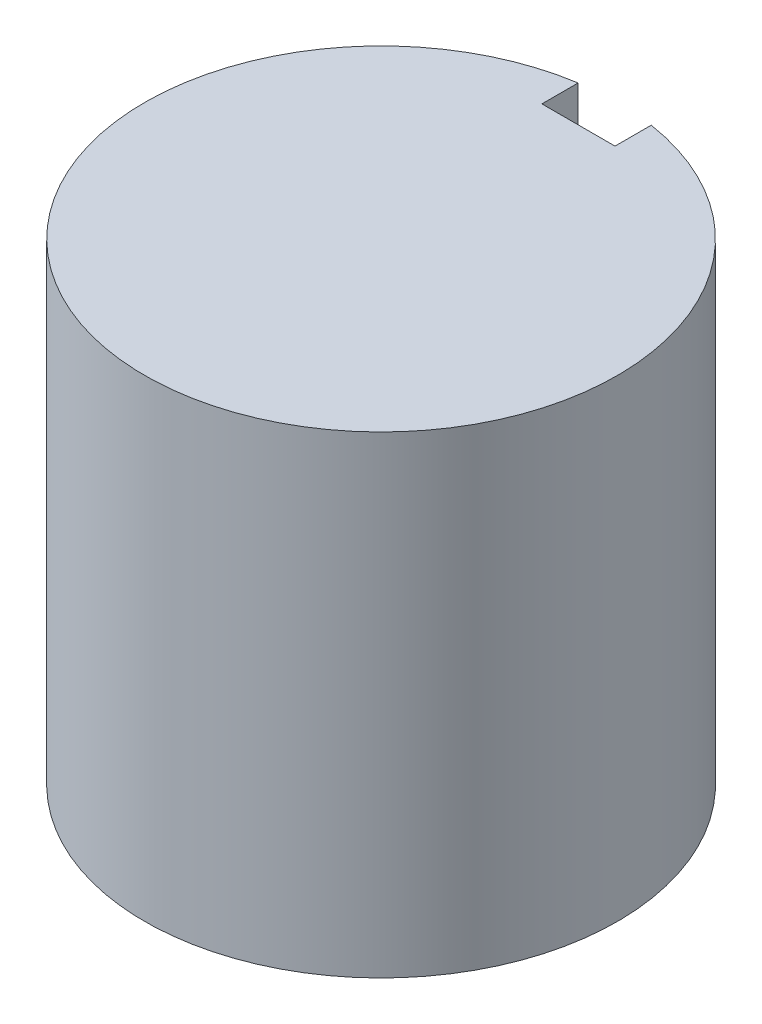
ISO-10303-21;
HEADER;
FILE_DESCRIPTION(('STEP AP214'),'2;1');
FILE_NAME('part.step','',(''),(''),'','','');
FILE_SCHEMA(('AUTOMOTIVE_DESIGN { 1 0 10303 214 1 1 1 1 }'));
ENDSEC;
DATA;
#1=APPLICATION_CONTEXT('core data for automotive mechanical design processes');
#2=APPLICATION_PROTOCOL_DEFINITION('international standard','automotive_design',2000,#1);
#3=PRODUCT_CONTEXT('',#1,'mechanical');
#4=PRODUCT('Part','Part','',(#3));
#5=PRODUCT_RELATED_PRODUCT_CATEGORY('part','',(#4));
#6=PRODUCT_DEFINITION_FORMATION('','',#4);
#7=PRODUCT_DEFINITION_CONTEXT('part definition',#1,'design');
#8=PRODUCT_DEFINITION('design','',#6,#7);
#9=PRODUCT_DEFINITION_SHAPE('','',#8);
#10=(LENGTH_UNIT() NAMED_UNIT(*) SI_UNIT(.MILLI.,.METRE.));
#11=(NAMED_UNIT(*) PLANE_ANGLE_UNIT() SI_UNIT($,.RADIAN.));
#12=(NAMED_UNIT(*) SI_UNIT($,.STERADIAN.) SOLID_ANGLE_UNIT());
#13=UNCERTAINTY_MEASURE_WITH_UNIT(LENGTH_MEASURE(1.E-05),#10,'distance_accuracy_value','');
#14=(GEOMETRIC_REPRESENTATION_CONTEXT(3) GLOBAL_UNCERTAINTY_ASSIGNED_CONTEXT((#13)) GLOBAL_UNIT_ASSIGNED_CONTEXT((#10,
#11,#12)) REPRESENTATION_CONTEXT('',''));
#15=CARTESIAN_POINT('',(0.,0.,0.));
#16=DIRECTION('',(0.,0.,1.));
#17=DIRECTION('',(1.,0.,0.));
#18=AXIS2_PLACEMENT_3D('',#15,#16,#17);
#19=CARTESIAN_POINT('',(0.,0.,-5.999988));
#20=DIRECTION('',(0.,1.,0.));
#21=DIRECTION('',(0.,0.,1.));
#22=AXIS2_PLACEMENT_3D('',#19,#20,#21);
#23=PLANE('',#22);
#24=CARTESIAN_POINT('',(0.,0.,0.));
#25=DIRECTION('',(0.,1.,0.));
#26=DIRECTION('',(1.,0.,0.));
#27=AXIS2_PLACEMENT_3D('',#24,#25,#26);
#28=CIRCLE('',#27,5.9944);
#29=CARTESIAN_POINT('',(-0.9271,0.,-5.9222729547024));
#30=VERTEX_POINT('',#29);
#31=CARTESIAN_POINT('',(0.9271,0.,-5.9222729547024));
#32=VERTEX_POINT('',#31);
#33=EDGE_CURVE('E11',#30,#32,#28,.T.);
#34=ORIENTED_EDGE('',*,*,#33,.F.);
#35=DIRECTION('',(0.,0.,-1.));
#36=VECTOR('',#35,1.);
#37=CARTESIAN_POINT('',(-0.9271,0.,-5.0038));
#38=LINE('',#37,#36);
#39=CARTESIAN_POINT('',(-0.9271,0.,-5.0038));
#40=VERTEX_POINT('',#39);
#41=EDGE_CURVE('E25',#40,#30,#38,.T.);
#42=ORIENTED_EDGE('',*,*,#41,.F.);
#43=DIRECTION('',(1.,0.,0.));
#44=VECTOR('',#43,1.);
#45=CARTESIAN_POINT('',(0.,0.,-5.0038));
#46=LINE('',#45,#44);
#47=CARTESIAN_POINT('',(0.9271,0.,-5.0038));
#48=VERTEX_POINT('',#47);
#49=EDGE_CURVE('E70',#40,#48,#46,.T.);
#50=ORIENTED_EDGE('',*,*,#49,.T.);
#51=DIRECTION('',(0.,0.,1.));
#52=VECTOR('',#51,1.);
#53=CARTESIAN_POINT('',(0.9271,0.,-5.9222729547024));
#54=LINE('',#53,#52);
#55=EDGE_CURVE('E99',#32,#48,#54,.T.);
#56=ORIENTED_EDGE('',*,*,#55,.F.);
#57=EDGE_LOOP('',(#34,#42,#50,#56));
#58=FACE_BOUND('',#57,.T.);
#59=ADVANCED_FACE('F17',(#58),#23,.F.);
#60=CARTESIAN_POINT('',(0.9271,11.9888,-5.9222729547024));
#61=DIRECTION('',(1.,0.,0.));
#62=DIRECTION('',(0.,0.,-1.));
#63=AXIS2_PLACEMENT_3D('',#60,#61,#62);
#64=PLANE('',#63);
#65=ORIENTED_EDGE('',*,*,#55,.T.);
#66=DIRECTION('',(0.,-1.,0.));
#67=VECTOR('',#66,1.);
#68=CARTESIAN_POINT('',(0.9271,11.9888,-5.0038));
#69=LINE('',#68,#67);
#70=CARTESIAN_POINT('',(0.9271,11.9888,-5.0038));
#71=VERTEX_POINT('',#70);
#72=EDGE_CURVE('E95',#71,#48,#69,.T.);
#73=ORIENTED_EDGE('',*,*,#72,.F.);
#74=DIRECTION('',(0.,0.,1.));
#75=VECTOR('',#74,1.);
#76=CARTESIAN_POINT('',(0.9271,11.9888,-5.9222729547024));
#77=LINE('',#76,#75);
#78=CARTESIAN_POINT('',(0.9271,11.9888,-5.9222729547024));
#79=VERTEX_POINT('',#78);
#80=EDGE_CURVE('E73',#79,#71,#77,.T.);
#81=ORIENTED_EDGE('',*,*,#80,.F.);
#82=DIRECTION('',(0.,-1.,0.));
#83=VECTOR('',#82,1.);
#84=CARTESIAN_POINT('',(0.9271,11.9888,-5.9222729547024));
#85=LINE('',#84,#83);
#86=EDGE_CURVE('E87',#79,#32,#85,.T.);
#87=ORIENTED_EDGE('',*,*,#86,.T.);
#88=EDGE_LOOP('',(#65,#73,#81,#87));
#89=FACE_BOUND('',#88,.T.);
#90=ADVANCED_FACE('F112',(#89),#64,.F.);
#91=CARTESIAN_POINT('',(0.,11.9888,0.));
#92=DIRECTION('',(0.,-1.,0.));
#93=DIRECTION('',(0.,0.,-1.));
#94=AXIS2_PLACEMENT_3D('',#91,#92,#93);
#95=CYLINDRICAL_SURFACE('',#94,5.9944);
#96=ORIENTED_EDGE('',*,*,#33,.T.);
#97=ORIENTED_EDGE('',*,*,#86,.F.);
#98=CARTESIAN_POINT('',(0.,11.9888,0.));
#99=DIRECTION('',(0.,1.,0.));
#100=DIRECTION('',(1.,0.,0.));
#101=AXIS2_PLACEMENT_3D('',#98,#99,#100);
#102=CIRCLE('',#101,5.9944);
#103=CARTESIAN_POINT('',(-0.9271,11.9888,-5.9222729547024));
#104=VERTEX_POINT('',#103);
#105=EDGE_CURVE('E83',#104,#79,#102,.T.);
#106=ORIENTED_EDGE('',*,*,#105,.F.);
#107=DIRECTION('',(0.,-1.,0.));
#108=VECTOR('',#107,1.);
#109=CARTESIAN_POINT('',(-0.9271,11.9888,-5.9222729547024));
#110=LINE('',#109,#108);
#111=EDGE_CURVE('E59',#104,#30,#110,.T.);
#112=ORIENTED_EDGE('',*,*,#111,.T.);
#113=EDGE_LOOP('',(#96,#97,#106,#112));
#114=FACE_BOUND('',#113,.T.);
#115=ADVANCED_FACE('F115',(#114),#95,.T.);
#116=CARTESIAN_POINT('',(-0.9271,11.9888,-5.0038));
#117=DIRECTION('',(-1.,0.,0.));
#118=DIRECTION('',(0.,0.,1.));
#119=AXIS2_PLACEMENT_3D('',#116,#117,#118);
#120=PLANE('',#119);
#121=ORIENTED_EDGE('',*,*,#41,.T.);
#122=ORIENTED_EDGE('',*,*,#111,.F.);
#123=DIRECTION('',(0.,0.,-1.));
#124=VECTOR('',#123,1.);
#125=CARTESIAN_POINT('',(-0.9271,11.9888,-5.0038));
#126=LINE('',#125,#124);
#127=CARTESIAN_POINT('',(-0.9271,11.9888,-5.0038));
#128=VERTEX_POINT('',#127);
#129=EDGE_CURVE('E54',#128,#104,#126,.T.);
#130=ORIENTED_EDGE('',*,*,#129,.F.);
#131=DIRECTION('',(0.,-1.,0.));
#132=VECTOR('',#131,1.);
#133=CARTESIAN_POINT('',(-0.9271,11.9888,-5.0038));
#134=LINE('',#133,#132);
#135=EDGE_CURVE('E57',#128,#40,#134,.T.);
#136=ORIENTED_EDGE('',*,*,#135,.T.);
#137=EDGE_LOOP('',(#121,#122,#130,#136));
#138=FACE_BOUND('',#137,.T.);
#139=ADVANCED_FACE('F56',(#138),#120,.F.);
#140=CARTESIAN_POINT('',(0.9271,11.9888,-5.0038));
#141=DIRECTION('',(0.,0.,1.));
#142=DIRECTION('',(1.,0.,0.));
#143=AXIS2_PLACEMENT_3D('',#140,#141,#142);
#144=PLANE('',#143);
#145=ORIENTED_EDGE('',*,*,#72,.T.);
#146=ORIENTED_EDGE('',*,*,#49,.F.);
#147=ORIENTED_EDGE('',*,*,#135,.F.);
#148=DIRECTION('',(-1.,0.,0.));
#149=VECTOR('',#148,1.);
#150=CARTESIAN_POINT('',(0.9271,11.9888,-5.0038));
#151=LINE('',#150,#149);
#152=EDGE_CURVE('E68',#71,#128,#151,.T.);
#153=ORIENTED_EDGE('',*,*,#152,.F.);
#154=EDGE_LOOP('',(#145,#146,#147,#153));
#155=FACE_BOUND('',#154,.T.);
#156=ADVANCED_FACE('F67',(#155),#144,.F.);
#157=CARTESIAN_POINT('',(0.,11.9888,0.));
#158=DIRECTION('',(0.,-1.,0.));
#159=DIRECTION('',(0.,0.,-1.));
#160=AXIS2_PLACEMENT_3D('',#157,#158,#159);
#161=PLANE('',#160);
#162=ORIENTED_EDGE('',*,*,#152,.T.);
#163=ORIENTED_EDGE('',*,*,#129,.T.);
#164=ORIENTED_EDGE('',*,*,#105,.T.);
#165=ORIENTED_EDGE('',*,*,#80,.T.);
#166=EDGE_LOOP('',(#162,#163,#164,#165));
#167=FACE_BOUND('',#166,.T.);
#168=ADVANCED_FACE('F72',(#167),#161,.F.);
#169=CLOSED_SHELL('',(#59,#90,#115,#139,#156,#168));
#170=MANIFOLD_SOLID_BREP('B1',#169);
#171=ADVANCED_BREP_SHAPE_REPRESENTATION('',(#18,#170),#14);
#172=SHAPE_DEFINITION_REPRESENTATION(#9,#171);
ENDSEC;
END-ISO-10303-21;
